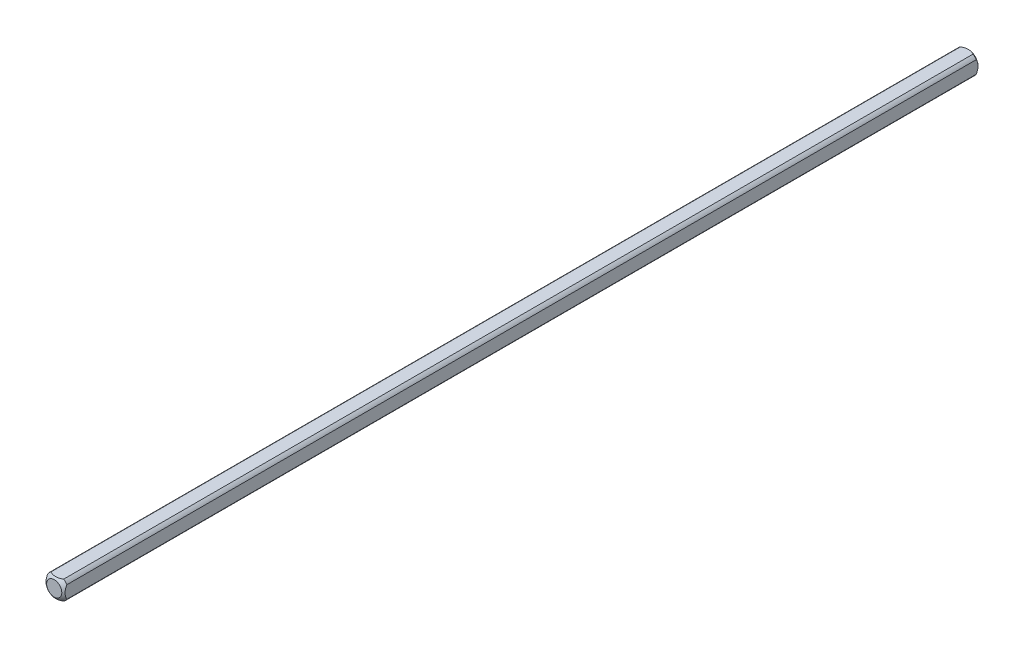
ISO-10303-21;
HEADER;
FILE_DESCRIPTION(('STEP AP214'),'2;1');
FILE_NAME('part.step','',(''),(''),'','','');
FILE_SCHEMA(('AUTOMOTIVE_DESIGN { 1 0 10303 214 1 1 1 1 }'));
ENDSEC;
DATA;
#1=APPLICATION_CONTEXT('core data for automotive mechanical design processes');
#2=APPLICATION_PROTOCOL_DEFINITION('international standard','automotive_design',2000,#1);
#3=PRODUCT_CONTEXT('',#1,'mechanical');
#4=PRODUCT('Part','Part','',(#3));
#5=PRODUCT_RELATED_PRODUCT_CATEGORY('part','',(#4));
#6=PRODUCT_DEFINITION_FORMATION('','',#4);
#7=PRODUCT_DEFINITION_CONTEXT('part definition',#1,'design');
#8=PRODUCT_DEFINITION('design','',#6,#7);
#9=PRODUCT_DEFINITION_SHAPE('','',#8);
#10=(LENGTH_UNIT() NAMED_UNIT(*) SI_UNIT(.MILLI.,.METRE.));
#11=(NAMED_UNIT(*) PLANE_ANGLE_UNIT() SI_UNIT($,.RADIAN.));
#12=(NAMED_UNIT(*) SI_UNIT($,.STERADIAN.) SOLID_ANGLE_UNIT());
#13=UNCERTAINTY_MEASURE_WITH_UNIT(LENGTH_MEASURE(1.E-05),#10,'distance_accuracy_value','');
#14=(GEOMETRIC_REPRESENTATION_CONTEXT(3) GLOBAL_UNCERTAINTY_ASSIGNED_CONTEXT((#13)) GLOBAL_UNIT_ASSIGNED_CONTEXT((#10,
#11,#12)) REPRESENTATION_CONTEXT('',''));
#15=CARTESIAN_POINT('',(0.,0.,0.));
#16=DIRECTION('',(0.,0.,1.));
#17=DIRECTION('',(1.,0.,0.));
#18=AXIS2_PLACEMENT_3D('',#15,#16,#17);
#19=CARTESIAN_POINT('',(-3.175,-3.175,152.4));
#20=DIRECTION('',(1.,0.,0.));
#21=DIRECTION('',(0.,0.,-1.));
#22=AXIS2_PLACEMENT_3D('',#19,#20,#21);
#23=PLANE('',#22);
#24=CARTESIAN_POINT('',(-3.175,0.,4.409725449428));
#25=DIRECTION('',(1.,0.,0.));
#26=DIRECTION('',(0.,0.,-1.));
#27=AXIS2_PLACEMENT_3D('',#24,#25,#26);
#28=CIRCLE('',#27,3.96557372898298);
#29=CARTESIAN_POINT('',(-3.175,-2.10605674187568,1.04962128437597));
#30=VERTEX_POINT('',#29);
#31=CARTESIAN_POINT('',(-3.175,2.10605674187568,1.04962128437608));
#32=VERTEX_POINT('',#31);
#33=EDGE_CURVE('E47',#30,#32,#28,.T.);
#34=ORIENTED_EDGE('',*,*,#33,.F.);
#35=DIRECTION('',(0.,0.,-1.));
#36=VECTOR('',#35,1.);
#37=CARTESIAN_POINT('',(-3.175,-2.10605674187568,152.4));
#38=LINE('',#37,#36);
#39=CARTESIAN_POINT('',(-3.175,-2.10605674187568,303.750378715624));
#40=VERTEX_POINT('',#39);
#41=EDGE_CURVE('E40',#40,#30,#38,.T.);
#42=ORIENTED_EDGE('',*,*,#41,.F.);
#43=CARTESIAN_POINT('',(-3.175,0.,300.390274550572));
#44=DIRECTION('',(-1.,0.,0.));
#45=DIRECTION('',(0.,0.,1.));
#46=AXIS2_PLACEMENT_3D('',#43,#44,#45);
#47=CIRCLE('',#46,3.96557372898298);
#48=CARTESIAN_POINT('',(-3.175,2.10605674187568,303.750378715624));
#49=VERTEX_POINT('',#48);
#50=EDGE_CURVE('E123',#40,#49,#47,.T.);
#51=ORIENTED_EDGE('',*,*,#50,.T.);
#52=DIRECTION('',(0.,0.,-1.));
#53=VECTOR('',#52,1.);
#54=CARTESIAN_POINT('',(-3.175,2.10605674187568,152.4));
#55=LINE('',#54,#53);
#56=EDGE_CURVE('E111',#32,#49,#55,.F.);
#57=ORIENTED_EDGE('',*,*,#56,.F.);
#58=EDGE_LOOP('',(#34,#42,#51,#57));
#59=FACE_BOUND('',#58,.T.);
#60=ADVANCED_FACE('F33',(#59),#23,.F.);
#61=CARTESIAN_POINT('',(-3.175,-3.175,152.4));
#62=DIRECTION('',(0.,1.,0.));
#63=DIRECTION('',(0.,0.,1.));
#64=AXIS2_PLACEMENT_3D('',#61,#62,#63);
#65=PLANE('',#64);
#66=CARTESIAN_POINT('',(0.,-3.175,4.409725449428));
#67=DIRECTION('',(0.,1.,0.));
#68=DIRECTION('',(0.,0.,1.));
#69=AXIS2_PLACEMENT_3D('',#66,#67,#68);
#70=CIRCLE('',#69,3.96557372898298);
#71=CARTESIAN_POINT('',(2.10605674187568,-3.175,1.04962128437597));
#72=VERTEX_POINT('',#71);
#73=CARTESIAN_POINT('',(-2.10605674187568,-3.175,1.04962128437602));
#74=VERTEX_POINT('',#73);
#75=EDGE_CURVE('E152',#72,#74,#70,.T.);
#76=ORIENTED_EDGE('',*,*,#75,.F.);
#77=DIRECTION('',(0.,0.,-1.));
#78=VECTOR('',#77,1.);
#79=CARTESIAN_POINT('',(2.10605674187568,-3.175,152.4));
#80=LINE('',#79,#78);
#81=CARTESIAN_POINT('',(2.10605674187568,-3.175,303.750378715624));
#82=VERTEX_POINT('',#81);
#83=EDGE_CURVE('E165',#82,#72,#80,.T.);
#84=ORIENTED_EDGE('',*,*,#83,.F.);
#85=CARTESIAN_POINT('',(0.,-3.175,300.390274550572));
#86=DIRECTION('',(0.,-1.,0.));
#87=DIRECTION('',(0.,0.,-1.));
#88=AXIS2_PLACEMENT_3D('',#85,#86,#87);
#89=CIRCLE('',#88,3.96557372898298);
#90=CARTESIAN_POINT('',(-2.10605674187568,-3.175,303.750378715624));
#91=VERTEX_POINT('',#90);
#92=EDGE_CURVE('E134',#82,#91,#89,.T.);
#93=ORIENTED_EDGE('',*,*,#92,.T.);
#94=DIRECTION('',(0.,0.,-1.));
#95=VECTOR('',#94,1.);
#96=CARTESIAN_POINT('',(-2.10605674187568,-3.175,152.4));
#97=LINE('',#96,#95);
#98=EDGE_CURVE('E163',#74,#91,#97,.F.);
#99=ORIENTED_EDGE('',*,*,#98,.F.);
#100=EDGE_LOOP('',(#76,#84,#93,#99));
#101=FACE_BOUND('',#100,.T.);
#102=ADVANCED_FACE('F175',(#101),#65,.F.);
#103=CARTESIAN_POINT('',(3.175,-3.175,152.4));
#104=DIRECTION('',(-1.,0.,0.));
#105=DIRECTION('',(0.,0.,1.));
#106=AXIS2_PLACEMENT_3D('',#103,#104,#105);
#107=PLANE('',#106);
#108=CARTESIAN_POINT('',(3.175,0.,4.409725449428));
#109=DIRECTION('',(-1.,0.,0.));
#110=DIRECTION('',(0.,0.,1.));
#111=AXIS2_PLACEMENT_3D('',#108,#109,#110);
#112=CIRCLE('',#111,3.96557372898298);
#113=CARTESIAN_POINT('',(3.175,2.10605674187568,1.04962128437602));
#114=VERTEX_POINT('',#113);
#115=CARTESIAN_POINT('',(3.175,-2.10605674187568,1.04962128437597));
#116=VERTEX_POINT('',#115);
#117=EDGE_CURVE('E150',#114,#116,#112,.T.);
#118=ORIENTED_EDGE('',*,*,#117,.F.);
#119=DIRECTION('',(0.,0.,-1.));
#120=VECTOR('',#119,1.);
#121=CARTESIAN_POINT('',(3.175,2.10605674187568,152.4));
#122=LINE('',#121,#120);
#123=CARTESIAN_POINT('',(3.175,2.10605674187568,303.750378715624));
#124=VERTEX_POINT('',#123);
#125=EDGE_CURVE('E160',#124,#114,#122,.T.);
#126=ORIENTED_EDGE('',*,*,#125,.F.);
#127=CARTESIAN_POINT('',(3.175,0.,300.390274550572));
#128=DIRECTION('',(1.,0.,0.));
#129=DIRECTION('',(0.,0.,-1.));
#130=AXIS2_PLACEMENT_3D('',#127,#128,#129);
#131=CIRCLE('',#130,3.96557372898298);
#132=CARTESIAN_POINT('',(3.175,-2.10605674187568,303.750378715624));
#133=VERTEX_POINT('',#132);
#134=EDGE_CURVE('E131',#124,#133,#131,.T.);
#135=ORIENTED_EDGE('',*,*,#134,.T.);
#136=DIRECTION('',(0.,0.,-1.));
#137=VECTOR('',#136,1.);
#138=CARTESIAN_POINT('',(3.175,-2.10605674187568,152.4));
#139=LINE('',#138,#137);
#140=EDGE_CURVE('E104',#116,#133,#139,.F.);
#141=ORIENTED_EDGE('',*,*,#140,.F.);
#142=EDGE_LOOP('',(#118,#126,#135,#141));
#143=FACE_BOUND('',#142,.T.);
#144=ADVANCED_FACE('F182',(#143),#107,.F.);
#145=CARTESIAN_POINT('',(-3.175,3.175,152.4));
#146=DIRECTION('',(0.,-1.,0.));
#147=DIRECTION('',(0.,0.,-1.));
#148=AXIS2_PLACEMENT_3D('',#145,#146,#147);
#149=PLANE('',#148);
#150=CARTESIAN_POINT('',(0.,3.175,4.409725449428));
#151=DIRECTION('',(0.,-1.,0.));
#152=DIRECTION('',(0.,0.,-1.));
#153=AXIS2_PLACEMENT_3D('',#150,#151,#152);
#154=CIRCLE('',#153,3.96557372898299);
#155=CARTESIAN_POINT('',(-2.10605674187568,3.175,1.04962128437602));
#156=VERTEX_POINT('',#155);
#157=CARTESIAN_POINT('',(2.10605674187568,3.175,1.04962128437597));
#158=VERTEX_POINT('',#157);
#159=EDGE_CURVE('E102',#156,#158,#154,.T.);
#160=ORIENTED_EDGE('',*,*,#159,.F.);
#161=DIRECTION('',(0.,0.,-1.));
#162=VECTOR('',#161,1.);
#163=CARTESIAN_POINT('',(-2.10605674187568,3.175,152.4));
#164=LINE('',#163,#162);
#165=CARTESIAN_POINT('',(-2.10605674187568,3.175,303.750378715624));
#166=VERTEX_POINT('',#165);
#167=EDGE_CURVE('E96',#166,#156,#164,.T.);
#168=ORIENTED_EDGE('',*,*,#167,.F.);
#169=CARTESIAN_POINT('',(0.,3.175,300.390274550572));
#170=DIRECTION('',(0.,1.,0.));
#171=DIRECTION('',(0.,0.,1.));
#172=AXIS2_PLACEMENT_3D('',#169,#170,#171);
#173=CIRCLE('',#172,3.96557372898299);
#174=CARTESIAN_POINT('',(2.10605674187568,3.175,303.750378715624));
#175=VERTEX_POINT('',#174);
#176=EDGE_CURVE('E101',#166,#175,#173,.T.);
#177=ORIENTED_EDGE('',*,*,#176,.T.);
#178=DIRECTION('',(0.,0.,-1.));
#179=VECTOR('',#178,1.);
#180=CARTESIAN_POINT('',(2.10605674187568,3.175,152.4));
#181=LINE('',#180,#179);
#182=EDGE_CURVE('E105',#158,#175,#181,.F.);
#183=ORIENTED_EDGE('',*,*,#182,.F.);
#184=EDGE_LOOP('',(#160,#168,#177,#183));
#185=FACE_BOUND('',#184,.T.);
#186=ADVANCED_FACE('F98',(#185),#149,.F.);
#187=CARTESIAN_POINT('',(0.,0.,152.4));
#188=DIRECTION('',(0.,0.,-1.));
#189=DIRECTION('',(-1.,0.,0.));
#190=AXIS2_PLACEMENT_3D('',#187,#188,#189);
#191=CYLINDRICAL_SURFACE('',#190,3.81);
#192=ORIENTED_EDGE('',*,*,#41,.T.);
#193=CARTESIAN_POINT('',(0.,0.,1.04962128437602));
#194=DIRECTION('',(0.,0.,1.));
#195=DIRECTION('',(1.,0.,0.));
#196=AXIS2_PLACEMENT_3D('',#193,#194,#195);
#197=CIRCLE('',#196,3.81);
#198=EDGE_CURVE('E147',#30,#74,#197,.T.);
#199=ORIENTED_EDGE('',*,*,#198,.T.);
#200=ORIENTED_EDGE('',*,*,#98,.T.);
#201=CARTESIAN_POINT('',(0.,0.,303.750378715624));
#202=DIRECTION('',(0.,0.,1.));
#203=DIRECTION('',(1.,0.,0.));
#204=AXIS2_PLACEMENT_3D('',#201,#202,#203);
#205=CIRCLE('',#204,3.81);
#206=EDGE_CURVE('E128',#40,#91,#205,.T.);
#207=ORIENTED_EDGE('',*,*,#206,.F.);
#208=EDGE_LOOP('',(#192,#199,#200,#207));
#209=FACE_BOUND('',#208,.T.);
#210=ADVANCED_FACE('F171',(#209),#191,.T.);
#211=ORIENTED_EDGE('',*,*,#83,.T.);
#212=CARTESIAN_POINT('',(0.,0.,1.04962128437602));
#213=DIRECTION('',(0.,0.,1.));
#214=DIRECTION('',(1.,0.,0.));
#215=AXIS2_PLACEMENT_3D('',#212,#213,#214);
#216=CIRCLE('',#215,3.81);
#217=EDGE_CURVE('E53',#72,#116,#216,.T.);
#218=ORIENTED_EDGE('',*,*,#217,.T.);
#219=ORIENTED_EDGE('',*,*,#140,.T.);
#220=CARTESIAN_POINT('',(0.,0.,303.750378715624));
#221=DIRECTION('',(0.,0.,1.));
#222=DIRECTION('',(1.,0.,0.));
#223=AXIS2_PLACEMENT_3D('',#220,#221,#222);
#224=CIRCLE('',#223,3.81);
#225=EDGE_CURVE('E137',#82,#133,#224,.T.);
#226=ORIENTED_EDGE('',*,*,#225,.F.);
#227=EDGE_LOOP('',(#211,#218,#219,#226));
#228=FACE_BOUND('',#227,.T.);
#229=ADVANCED_FACE('F178',(#228),#191,.T.);
#230=ORIENTED_EDGE('',*,*,#125,.T.);
#231=CARTESIAN_POINT('',(0.,0.,1.04962128437602));
#232=DIRECTION('',(0.,0.,1.));
#233=DIRECTION('',(1.,0.,0.));
#234=AXIS2_PLACEMENT_3D('',#231,#232,#233);
#235=CIRCLE('',#234,3.81);
#236=EDGE_CURVE('E144',#114,#158,#235,.T.);
#237=ORIENTED_EDGE('',*,*,#236,.T.);
#238=ORIENTED_EDGE('',*,*,#182,.T.);
#239=CARTESIAN_POINT('',(0.,0.,303.750378715624));
#240=DIRECTION('',(0.,0.,1.));
#241=DIRECTION('',(1.,0.,0.));
#242=AXIS2_PLACEMENT_3D('',#239,#240,#241);
#243=CIRCLE('',#242,3.81);
#244=EDGE_CURVE('E122',#124,#175,#243,.T.);
#245=ORIENTED_EDGE('',*,*,#244,.F.);
#246=EDGE_LOOP('',(#230,#237,#238,#245));
#247=FACE_BOUND('',#246,.T.);
#248=ADVANCED_FACE('F184',(#247),#191,.T.);
#249=ORIENTED_EDGE('',*,*,#167,.T.);
#250=CARTESIAN_POINT('',(0.,0.,1.04962128437602));
#251=DIRECTION('',(0.,0.,1.));
#252=DIRECTION('',(1.,0.,0.));
#253=AXIS2_PLACEMENT_3D('',#250,#251,#252);
#254=CIRCLE('',#253,3.81);
#255=EDGE_CURVE('E12',#156,#32,#254,.T.);
#256=ORIENTED_EDGE('',*,*,#255,.T.);
#257=ORIENTED_EDGE('',*,*,#56,.T.);
#258=CARTESIAN_POINT('',(0.,0.,303.750378715624));
#259=DIRECTION('',(0.,0.,1.));
#260=DIRECTION('',(1.,0.,0.));
#261=AXIS2_PLACEMENT_3D('',#258,#259,#260);
#262=CIRCLE('',#261,3.81);
#263=EDGE_CURVE('E108',#166,#49,#262,.T.);
#264=ORIENTED_EDGE('',*,*,#263,.F.);
#265=EDGE_LOOP('',(#249,#256,#257,#264));
#266=FACE_BOUND('',#265,.T.);
#267=ADVANCED_FACE('F109',(#266),#191,.T.);
#268=CARTESIAN_POINT('',(0.,0.,4.409725449428));
#269=DIRECTION('',(0.,0.,1.));
#270=DIRECTION('',(-1.,0.,0.));
#271=AXIS2_PLACEMENT_3D('',#268,#269,#270);
#272=SPHERICAL_SURFACE('',#271,5.08);
#273=CARTESIAN_POINT('',(0.,0.,0.));
#274=DIRECTION('',(0.,0.,-1.));
#275=DIRECTION('',(-1.,0.,0.));
#276=AXIS2_PLACEMENT_3D('',#273,#274,#275);
#277=CIRCLE('',#276,2.52204707740896);
#278=CARTESIAN_POINT('',(-2.52204707740896,0.,0.));
#279=VERTEX_POINT('',#278);
#280=EDGE_CURVE('E155',#279,#279,#277,.T.);
#281=ORIENTED_EDGE('',*,*,#280,.F.);
#282=EDGE_LOOP('',(#281));
#283=FACE_BOUND('',#282,.T.);
#284=ORIENTED_EDGE('',*,*,#75,.T.);
#285=ORIENTED_EDGE('',*,*,#198,.F.);
#286=ORIENTED_EDGE('',*,*,#33,.T.);
#287=ORIENTED_EDGE('',*,*,#255,.F.);
#288=ORIENTED_EDGE('',*,*,#159,.T.);
#289=ORIENTED_EDGE('',*,*,#236,.F.);
#290=ORIENTED_EDGE('',*,*,#117,.T.);
#291=ORIENTED_EDGE('',*,*,#217,.F.);
#292=EDGE_LOOP('',(#284,#285,#286,#287,#288,#289,#290,#291));
#293=FACE_BOUND('',#292,.T.);
#294=ADVANCED_FACE('F185',(#283,#293),#272,.T.);
#295=CARTESIAN_POINT('',(0.,0.,0.));
#296=DIRECTION('',(0.,0.,-1.));
#297=DIRECTION('',(-1.,0.,0.));
#298=AXIS2_PLACEMENT_3D('',#295,#296,#297);
#299=PLANE('',#298);
#300=ORIENTED_EDGE('',*,*,#280,.T.);
#301=EDGE_LOOP('',(#300));
#302=FACE_BOUND('',#301,.T.);
#303=ADVANCED_FACE('F187',(#302),#299,.T.);
#304=CARTESIAN_POINT('',(0.,0.,300.390274550572));
#305=DIRECTION('',(0.,0.,-1.));
#306=DIRECTION('',(-1.,0.,0.));
#307=AXIS2_PLACEMENT_3D('',#304,#305,#306);
#308=SPHERICAL_SURFACE('',#307,5.08);
#309=CARTESIAN_POINT('',(0.,0.,304.8));
#310=DIRECTION('',(0.,0.,-1.));
#311=DIRECTION('',(-1.,0.,0.));
#312=AXIS2_PLACEMENT_3D('',#309,#310,#311);
#313=CIRCLE('',#312,2.52204707740896);
#314=CARTESIAN_POINT('',(-2.52204707740896,0.,304.8));
#315=VERTEX_POINT('',#314);
#316=EDGE_CURVE('E115',#315,#315,#313,.T.);
#317=ORIENTED_EDGE('',*,*,#316,.T.);
#318=EDGE_LOOP('',(#317));
#319=FACE_BOUND('',#318,.T.);
#320=ORIENTED_EDGE('',*,*,#92,.F.);
#321=ORIENTED_EDGE('',*,*,#225,.T.);
#322=ORIENTED_EDGE('',*,*,#134,.F.);
#323=ORIENTED_EDGE('',*,*,#244,.T.);
#324=ORIENTED_EDGE('',*,*,#176,.F.);
#325=ORIENTED_EDGE('',*,*,#263,.T.);
#326=ORIENTED_EDGE('',*,*,#50,.F.);
#327=ORIENTED_EDGE('',*,*,#206,.T.);
#328=EDGE_LOOP('',(#320,#321,#322,#323,#324,#325,#326,#327));
#329=FACE_BOUND('',#328,.T.);
#330=ADVANCED_FACE('F119',(#319,#329),#308,.T.);
#331=CARTESIAN_POINT('',(0.,0.,304.8));
#332=DIRECTION('',(0.,0.,1.));
#333=DIRECTION('',(-1.,0.,0.));
#334=AXIS2_PLACEMENT_3D('',#331,#332,#333);
#335=PLANE('',#334);
#336=ORIENTED_EDGE('',*,*,#316,.F.);
#337=EDGE_LOOP('',(#336));
#338=FACE_BOUND('',#337,.T.);
#339=ADVANCED_FACE('F232',(#338),#335,.T.);
#340=CLOSED_SHELL('',(#60,#102,#144,#186,#210,#229,#248,#267,#294,#303,#330,#339));
#341=MANIFOLD_SOLID_BREP('B2',#340);
#342=ADVANCED_BREP_SHAPE_REPRESENTATION('',(#18,#341),#14);
#343=SHAPE_DEFINITION_REPRESENTATION(#9,#342);
ENDSEC;
END-ISO-10303-21;
